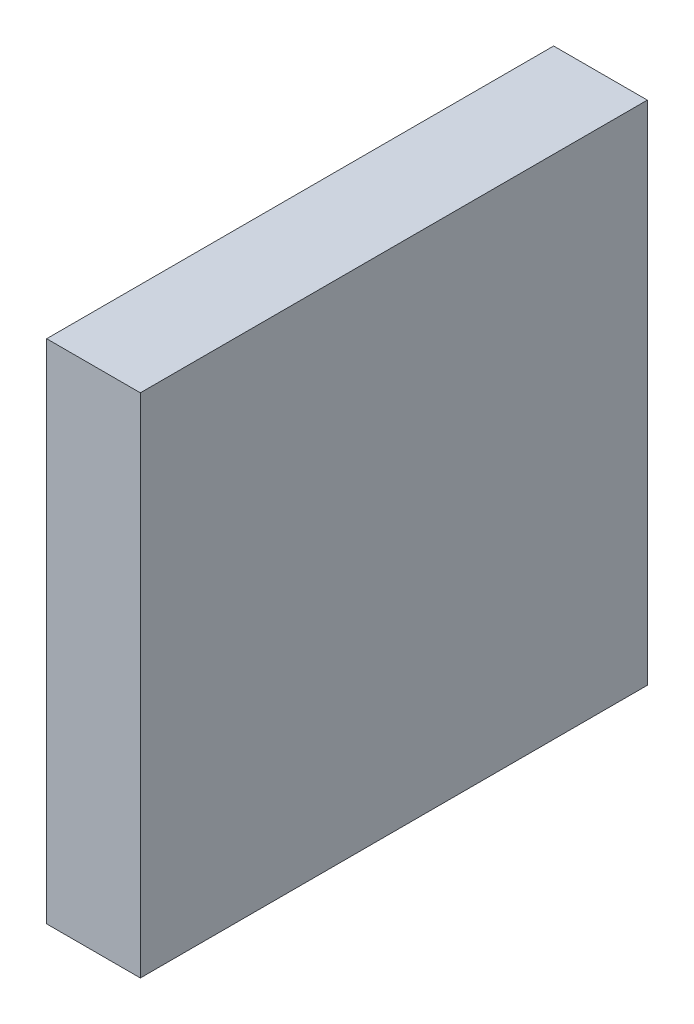
ISO-10303-21;
HEADER;
FILE_DESCRIPTION(('STEP AP214'),'2;1');
FILE_NAME('part.step','',(''),(''),'','','');
FILE_SCHEMA(('AUTOMOTIVE_DESIGN { 1 0 10303 214 1 1 1 1 }'));
ENDSEC;
DATA;
#1=APPLICATION_CONTEXT('core data for automotive mechanical design processes');
#2=APPLICATION_PROTOCOL_DEFINITION('international standard','automotive_design',2000,#1);
#3=PRODUCT_CONTEXT('',#1,'mechanical');
#4=PRODUCT('Part','Part','',(#3));
#5=PRODUCT_RELATED_PRODUCT_CATEGORY('part','',(#4));
#6=PRODUCT_DEFINITION_FORMATION('','',#4);
#7=PRODUCT_DEFINITION_CONTEXT('part definition',#1,'design');
#8=PRODUCT_DEFINITION('design','',#6,#7);
#9=PRODUCT_DEFINITION_SHAPE('','',#8);
#10=(LENGTH_UNIT() NAMED_UNIT(*) SI_UNIT(.MILLI.,.METRE.));
#11=(NAMED_UNIT(*) PLANE_ANGLE_UNIT() SI_UNIT($,.RADIAN.));
#12=(NAMED_UNIT(*) SI_UNIT($,.STERADIAN.) SOLID_ANGLE_UNIT());
#13=UNCERTAINTY_MEASURE_WITH_UNIT(LENGTH_MEASURE(1.E-05),#10,'distance_accuracy_value','');
#14=(GEOMETRIC_REPRESENTATION_CONTEXT(3) GLOBAL_UNCERTAINTY_ASSIGNED_CONTEXT((#13)) GLOBAL_UNIT_ASSIGNED_CONTEXT((#10,
#11,#12)) REPRESENTATION_CONTEXT('',''));
#15=CARTESIAN_POINT('',(0.,0.,0.));
#16=DIRECTION('',(0.,0.,1.));
#17=DIRECTION('',(1.,0.,0.));
#18=AXIS2_PLACEMENT_3D('',#15,#16,#17);
#19=CARTESIAN_POINT('',(0.2494915,1.34949184,0.));
#20=DIRECTION('',(1.,0.,0.));
#21=DIRECTION('',(0.,0.,-1.));
#22=AXIS2_PLACEMENT_3D('',#19,#20,#21);
#23=PLANE('',#22);
#24=DIRECTION('',(0.,0.,-1.));
#25=VECTOR('',#24,1.);
#26=CARTESIAN_POINT('',(0.2494915,-1.34949184,0.));
#27=LINE('',#26,#25);
#28=CARTESIAN_POINT('',(0.2494915,-1.34949184,0.));
#29=VERTEX_POINT('',#28);
#30=CARTESIAN_POINT('',(0.2494915,-1.34949184,2.69999968));
#31=VERTEX_POINT('',#30);
#32=EDGE_CURVE('E20',#29,#31,#27,.F.);
#33=ORIENTED_EDGE('',*,*,#32,.F.);
#34=DIRECTION('',(0.,1.,0.));
#35=VECTOR('',#34,1.);
#36=CARTESIAN_POINT('',(0.2494915,0.,0.));
#37=LINE('',#36,#35);
#38=CARTESIAN_POINT('',(0.2494915,1.34949184,0.));
#39=VERTEX_POINT('',#38);
#40=EDGE_CURVE('E80',#39,#29,#37,.F.);
#41=ORIENTED_EDGE('',*,*,#40,.F.);
#42=DIRECTION('',(0.,0.,1.));
#43=VECTOR('',#42,1.);
#44=CARTESIAN_POINT('',(0.2494915,1.34949184,0.));
#45=LINE('',#44,#43);
#46=CARTESIAN_POINT('',(0.2494915,1.34949184,2.69999968));
#47=VERTEX_POINT('',#46);
#48=EDGE_CURVE('E61',#47,#39,#45,.F.);
#49=ORIENTED_EDGE('',*,*,#48,.F.);
#50=DIRECTION('',(0.,1.,0.));
#51=VECTOR('',#50,1.);
#52=CARTESIAN_POINT('',(0.2494915,0.,2.69999968));
#53=LINE('',#52,#51);
#54=EDGE_CURVE('E55',#47,#31,#53,.F.);
#55=ORIENTED_EDGE('',*,*,#54,.T.);
#56=EDGE_LOOP('',(#33,#41,#49,#55));
#57=FACE_BOUND('',#56,.T.);
#58=ADVANCED_FACE('F17',(#57),#23,.T.);
#59=CARTESIAN_POINT('',(0.2494915,-1.34949184,0.));
#60=DIRECTION('',(0.,-1.,0.));
#61=DIRECTION('',(0.,0.,-1.));
#62=AXIS2_PLACEMENT_3D('',#59,#60,#61);
#63=PLANE('',#62);
#64=DIRECTION('',(0.,0.,1.));
#65=VECTOR('',#64,1.);
#66=CARTESIAN_POINT('',(-0.2494915,-1.34949184,0.));
#67=LINE('',#66,#65);
#68=CARTESIAN_POINT('',(-0.2494915,-1.34949184,0.));
#69=VERTEX_POINT('',#68);
#70=CARTESIAN_POINT('',(-0.2494915,-1.34949184,2.69999968));
#71=VERTEX_POINT('',#70);
#72=EDGE_CURVE('E83',#69,#71,#67,.T.);
#73=ORIENTED_EDGE('',*,*,#72,.F.);
#74=DIRECTION('',(-1.,0.,0.));
#75=VECTOR('',#74,1.);
#76=CARTESIAN_POINT('',(0.,-1.34949184,0.));
#77=LINE('',#76,#75);
#78=EDGE_CURVE('E68',#29,#69,#77,.T.);
#79=ORIENTED_EDGE('',*,*,#78,.F.);
#80=ORIENTED_EDGE('',*,*,#32,.T.);
#81=DIRECTION('',(-1.,0.,0.));
#82=VECTOR('',#81,1.);
#83=CARTESIAN_POINT('',(0.,-1.34949184,2.69999968));
#84=LINE('',#83,#82);
#85=EDGE_CURVE('E63',#31,#71,#84,.T.);
#86=ORIENTED_EDGE('',*,*,#85,.T.);
#87=EDGE_LOOP('',(#73,#79,#80,#86));
#88=FACE_BOUND('',#87,.T.);
#89=ADVANCED_FACE('F65',(#88),#63,.T.);
#90=CARTESIAN_POINT('',(0.,0.,2.69999968));
#91=DIRECTION('',(0.,0.,-1.));
#92=DIRECTION('',(-1.,0.,0.));
#93=AXIS2_PLACEMENT_3D('',#90,#91,#92);
#94=PLANE('',#93);
#95=ORIENTED_EDGE('',*,*,#54,.F.);
#96=DIRECTION('',(1.,0.,0.));
#97=VECTOR('',#96,1.);
#98=CARTESIAN_POINT('',(-0.2494915,1.34949184,2.69999968));
#99=LINE('',#98,#97);
#100=CARTESIAN_POINT('',(-0.2494915,1.34949184,2.69999968));
#101=VERTEX_POINT('',#100);
#102=EDGE_CURVE('E74',#101,#47,#99,.T.);
#103=ORIENTED_EDGE('',*,*,#102,.F.);
#104=DIRECTION('',(0.,1.,0.));
#105=VECTOR('',#104,1.);
#106=CARTESIAN_POINT('',(-0.2494915,-1.34949184,2.69999968));
#107=LINE('',#106,#105);
#108=EDGE_CURVE('E72',#71,#101,#107,.T.);
#109=ORIENTED_EDGE('',*,*,#108,.F.);
#110=ORIENTED_EDGE('',*,*,#85,.F.);
#111=EDGE_LOOP('',(#95,#103,#109,#110));
#112=FACE_BOUND('',#111,.T.);
#113=ADVANCED_FACE('F70',(#112),#94,.F.);
#114=CARTESIAN_POINT('',(-0.2494915,1.34949184,0.));
#115=DIRECTION('',(0.,1.,0.));
#116=DIRECTION('',(0.,0.,1.));
#117=AXIS2_PLACEMENT_3D('',#114,#115,#116);
#118=PLANE('',#117);
#119=ORIENTED_EDGE('',*,*,#48,.T.);
#120=DIRECTION('',(-1.,0.,0.));
#121=VECTOR('',#120,1.);
#122=CARTESIAN_POINT('',(0.,1.34949184,0.));
#123=LINE('',#122,#121);
#124=CARTESIAN_POINT('',(-0.2494915,1.34949184,0.));
#125=VERTEX_POINT('',#124);
#126=EDGE_CURVE('E35',#125,#39,#123,.F.);
#127=ORIENTED_EDGE('',*,*,#126,.F.);
#128=DIRECTION('',(0.,0.,1.));
#129=VECTOR('',#128,1.);
#130=CARTESIAN_POINT('',(-0.2494915,1.34949184,0.));
#131=LINE('',#130,#129);
#132=EDGE_CURVE('E26',#101,#125,#131,.F.);
#133=ORIENTED_EDGE('',*,*,#132,.F.);
#134=ORIENTED_EDGE('',*,*,#102,.T.);
#135=EDGE_LOOP('',(#119,#127,#133,#134));
#136=FACE_BOUND('',#135,.T.);
#137=ADVANCED_FACE('F89',(#136),#118,.T.);
#138=CARTESIAN_POINT('',(0.,0.,0.));
#139=DIRECTION('',(0.,0.,-1.));
#140=DIRECTION('',(-1.,0.,0.));
#141=AXIS2_PLACEMENT_3D('',#138,#139,#140);
#142=PLANE('',#141);
#143=ORIENTED_EDGE('',*,*,#40,.T.);
#144=ORIENTED_EDGE('',*,*,#78,.T.);
#145=DIRECTION('',(0.,1.,0.));
#146=VECTOR('',#145,1.);
#147=CARTESIAN_POINT('',(-0.2494915,-1.34949184,0.));
#148=LINE('',#147,#146);
#149=EDGE_CURVE('E11',#125,#69,#148,.F.);
#150=ORIENTED_EDGE('',*,*,#149,.F.);
#151=ORIENTED_EDGE('',*,*,#126,.T.);
#152=EDGE_LOOP('',(#143,#144,#150,#151));
#153=FACE_BOUND('',#152,.T.);
#154=ADVANCED_FACE('F91',(#153),#142,.T.);
#155=CARTESIAN_POINT('',(-0.2494915,-1.34949184,0.));
#156=DIRECTION('',(-1.,0.,0.));
#157=DIRECTION('',(0.,0.,1.));
#158=AXIS2_PLACEMENT_3D('',#155,#156,#157);
#159=PLANE('',#158);
#160=ORIENTED_EDGE('',*,*,#132,.T.);
#161=ORIENTED_EDGE('',*,*,#149,.T.);
#162=ORIENTED_EDGE('',*,*,#72,.T.);
#163=ORIENTED_EDGE('',*,*,#108,.T.);
#164=EDGE_LOOP('',(#160,#161,#162,#163));
#165=FACE_BOUND('',#164,.T.);
#166=ADVANCED_FACE('F88',(#165),#159,.T.);
#167=CLOSED_SHELL('',(#58,#89,#113,#137,#154,#166));
#168=MANIFOLD_SOLID_BREP('B1',#167);
#169=ADVANCED_BREP_SHAPE_REPRESENTATION('',(#18,#168),#14);
#170=SHAPE_DEFINITION_REPRESENTATION(#9,#169);
ENDSEC;
END-ISO-10303-21;
